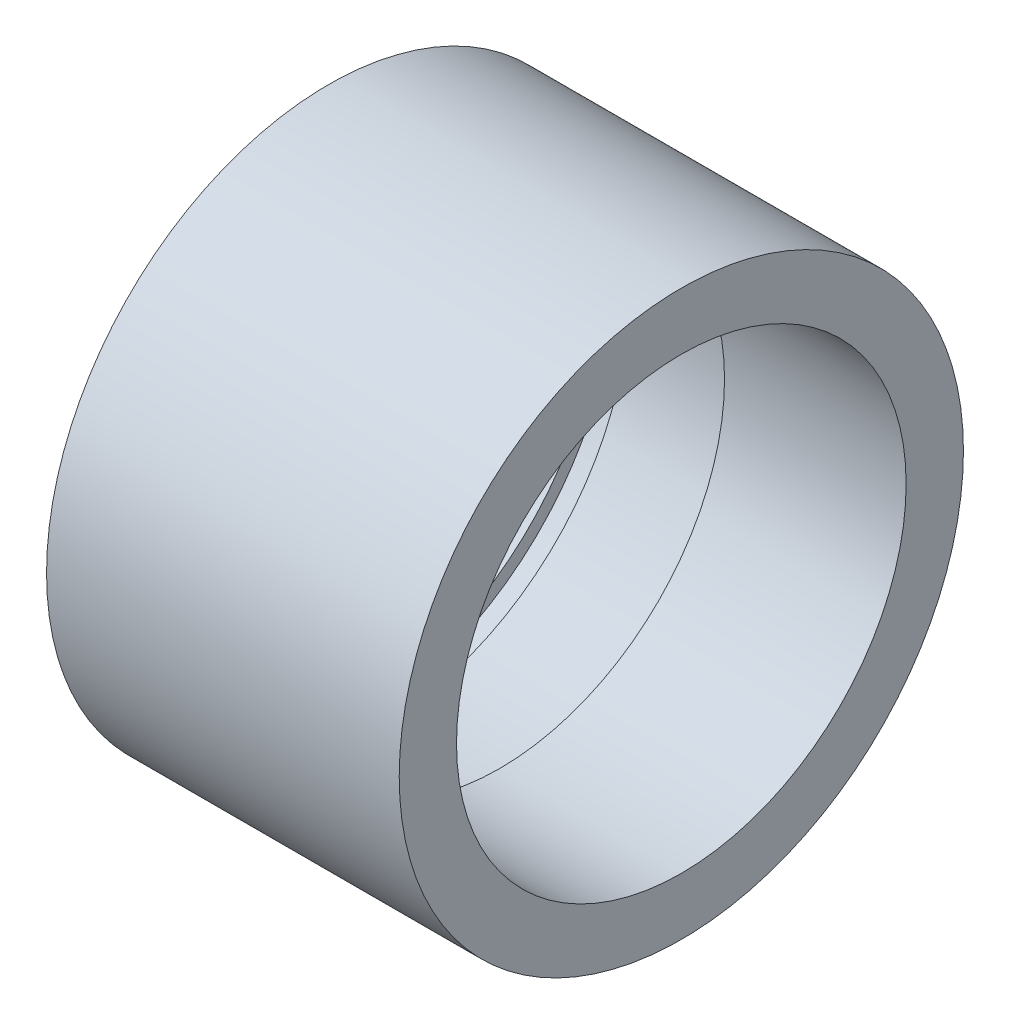
ISO-10303-21;
HEADER;
FILE_DESCRIPTION(('STEP AP214'),'2;1');
FILE_NAME('part.step','',(''),(''),'','','');
FILE_SCHEMA(('AUTOMOTIVE_DESIGN { 1 0 10303 214 1 1 1 1 }'));
ENDSEC;
DATA;
#1=APPLICATION_CONTEXT('core data for automotive mechanical design processes');
#2=APPLICATION_PROTOCOL_DEFINITION('international standard','automotive_design',2000,#1);
#3=PRODUCT_CONTEXT('',#1,'mechanical');
#4=PRODUCT('Part','Part','',(#3));
#5=PRODUCT_RELATED_PRODUCT_CATEGORY('part','',(#4));
#6=PRODUCT_DEFINITION_FORMATION('','',#4);
#7=PRODUCT_DEFINITION_CONTEXT('part definition',#1,'design');
#8=PRODUCT_DEFINITION('design','',#6,#7);
#9=PRODUCT_DEFINITION_SHAPE('','',#8);
#10=(LENGTH_UNIT() NAMED_UNIT(*) SI_UNIT(.MILLI.,.METRE.));
#11=(NAMED_UNIT(*) PLANE_ANGLE_UNIT() SI_UNIT($,.RADIAN.));
#12=(NAMED_UNIT(*) SI_UNIT($,.STERADIAN.) SOLID_ANGLE_UNIT());
#13=UNCERTAINTY_MEASURE_WITH_UNIT(LENGTH_MEASURE(1.E-05),#10,'distance_accuracy_value','');
#14=(GEOMETRIC_REPRESENTATION_CONTEXT(3) GLOBAL_UNCERTAINTY_ASSIGNED_CONTEXT((#13)) GLOBAL_UNIT_ASSIGNED_CONTEXT((#10,
#11,#12)) REPRESENTATION_CONTEXT('',''));
#15=CARTESIAN_POINT('',(0.,0.,0.));
#16=DIRECTION('',(0.,0.,1.));
#17=DIRECTION('',(1.,0.,0.));
#18=AXIS2_PLACEMENT_3D('',#15,#16,#17);
#19=CARTESIAN_POINT('',(-1.49999999999983,0.,-16.));
#20=DIRECTION('',(1.,0.,0.));
#21=DIRECTION('',(0.,0.,-1.));
#22=AXIS2_PLACEMENT_3D('',#19,#20,#21);
#23=PLANE('',#22);
#24=CARTESIAN_POINT('',(-1.49999999999983,0.,0.));
#25=DIRECTION('',(-1.,0.,0.));
#26=DIRECTION('',(0.,0.,1.));
#27=AXIS2_PLACEMENT_3D('',#24,#25,#26);
#28=CIRCLE('',#27,14.);
#29=CARTESIAN_POINT('',(-1.49999999999983,0.,14.));
#30=VERTEX_POINT('',#29);
#31=EDGE_CURVE('E10',#30,#30,#28,.T.);
#32=ORIENTED_EDGE('',*,*,#31,.F.);
#33=EDGE_LOOP('',(#32));
#34=FACE_BOUND('',#33,.T.);
#35=CARTESIAN_POINT('',(-1.49999999999983,0.,0.));
#36=DIRECTION('',(-1.,0.,0.));
#37=DIRECTION('',(0.,0.,1.));
#38=AXIS2_PLACEMENT_3D('',#35,#36,#37);
#39=CIRCLE('',#38,16.);
#40=CARTESIAN_POINT('',(-1.49999999999983,0.,16.));
#41=VERTEX_POINT('',#40);
#42=EDGE_CURVE('E67',#41,#41,#39,.T.);
#43=ORIENTED_EDGE('',*,*,#42,.T.);
#44=EDGE_LOOP('',(#43));
#45=FACE_BOUND('',#44,.T.);
#46=ADVANCED_FACE('F33',(#34,#45),#23,.F.);
#47=CARTESIAN_POINT('',(-1000.,0.,0.));
#48=DIRECTION('',(-1.,0.,0.));
#49=DIRECTION('',(0.,0.,1.));
#50=AXIS2_PLACEMENT_3D('',#47,#48,#49);
#51=CYLINDRICAL_SURFACE('',#50,14.);
#52=CARTESIAN_POINT('',(0.,0.,0.));
#53=DIRECTION('',(-1.,0.,0.));
#54=DIRECTION('',(0.,0.,1.));
#55=AXIS2_PLACEMENT_3D('',#52,#53,#54);
#56=CIRCLE('',#55,14.);
#57=CARTESIAN_POINT('',(0.,0.,14.));
#58=VERTEX_POINT('',#57);
#59=EDGE_CURVE('E39',#58,#58,#56,.T.);
#60=ORIENTED_EDGE('',*,*,#59,.F.);
#61=EDGE_LOOP('',(#60));
#62=FACE_BOUND('',#61,.T.);
#63=ORIENTED_EDGE('',*,*,#31,.T.);
#64=EDGE_LOOP('',(#63));
#65=FACE_BOUND('',#64,.T.);
#66=ADVANCED_FACE('F116',(#62,#65),#51,.F.);
#67=CARTESIAN_POINT('',(0.,0.,-14.));
#68=DIRECTION('',(-1.,0.,0.));
#69=DIRECTION('',(0.,0.,1.));
#70=AXIS2_PLACEMENT_3D('',#67,#68,#69);
#71=PLANE('',#70);
#72=CARTESIAN_POINT('',(0.,0.,0.));
#73=DIRECTION('',(-1.,0.,0.));
#74=DIRECTION('',(0.,0.,1.));
#75=AXIS2_PLACEMENT_3D('',#72,#73,#74);
#76=CIRCLE('',#75,14.7499999999999);
#77=CARTESIAN_POINT('',(0.,0.,14.7499999999999));
#78=VERTEX_POINT('',#77);
#79=EDGE_CURVE('E43',#78,#78,#76,.T.);
#80=ORIENTED_EDGE('',*,*,#79,.F.);
#81=EDGE_LOOP('',(#80));
#82=FACE_BOUND('',#81,.T.);
#83=ORIENTED_EDGE('',*,*,#59,.T.);
#84=EDGE_LOOP('',(#83));
#85=FACE_BOUND('',#84,.T.);
#86=ADVANCED_FACE('F111',(#82,#85),#71,.F.);
#87=CARTESIAN_POINT('',(-1000.,0.,0.));
#88=DIRECTION('',(-1.,0.,0.));
#89=DIRECTION('',(0.,0.,1.));
#90=AXIS2_PLACEMENT_3D('',#87,#88,#89);
#91=CYLINDRICAL_SURFACE('',#90,14.7499999999999);
#92=CARTESIAN_POINT('',(1.50000000000006,0.,0.));
#93=DIRECTION('',(-1.,0.,0.));
#94=DIRECTION('',(0.,0.,1.));
#95=AXIS2_PLACEMENT_3D('',#92,#93,#94);
#96=CIRCLE('',#95,14.7499999999999);
#97=CARTESIAN_POINT('',(1.50000000000006,0.,14.7499999999999));
#98=VERTEX_POINT('',#97);
#99=EDGE_CURVE('E47',#98,#98,#96,.T.);
#100=ORIENTED_EDGE('',*,*,#99,.F.);
#101=EDGE_LOOP('',(#100));
#102=FACE_BOUND('',#101,.T.);
#103=ORIENTED_EDGE('',*,*,#79,.T.);
#104=EDGE_LOOP('',(#103));
#105=FACE_BOUND('',#104,.T.);
#106=ADVANCED_FACE('F105',(#102,#105),#91,.F.);
#107=CARTESIAN_POINT('',(1.49999999999995,0.,-14.7499999999999));
#108=DIRECTION('',(1.,0.,0.));
#109=DIRECTION('',(0.,0.,-1.));
#110=AXIS2_PLACEMENT_3D('',#107,#108,#109);
#111=PLANE('',#110);
#112=CARTESIAN_POINT('',(1.50000000000006,0.,0.));
#113=DIRECTION('',(-1.,0.,0.));
#114=DIRECTION('',(0.,0.,1.));
#115=AXIS2_PLACEMENT_3D('',#112,#113,#114);
#116=CIRCLE('',#115,14.);
#117=CARTESIAN_POINT('',(1.50000000000006,0.,14.));
#118=VERTEX_POINT('',#117);
#119=EDGE_CURVE('E52',#118,#118,#116,.T.);
#120=ORIENTED_EDGE('',*,*,#119,.F.);
#121=EDGE_LOOP('',(#120));
#122=FACE_BOUND('',#121,.T.);
#123=ORIENTED_EDGE('',*,*,#99,.T.);
#124=EDGE_LOOP('',(#123));
#125=FACE_BOUND('',#124,.T.);
#126=ADVANCED_FACE('F99',(#122,#125),#111,.F.);
#127=CARTESIAN_POINT('',(-1000.,0.,0.));
#128=DIRECTION('',(-1.,0.,0.));
#129=DIRECTION('',(0.,0.,1.));
#130=AXIS2_PLACEMENT_3D('',#127,#128,#129);
#131=CYLINDRICAL_SURFACE('',#130,14.);
#132=CARTESIAN_POINT('',(8.19999999999999,0.,0.));
#133=DIRECTION('',(-1.,0.,0.));
#134=DIRECTION('',(0.,0.,1.));
#135=AXIS2_PLACEMENT_3D('',#132,#133,#134);
#136=CIRCLE('',#135,14.);
#137=CARTESIAN_POINT('',(8.19999999999999,0.,14.));
#138=VERTEX_POINT('',#137);
#139=EDGE_CURVE('E55',#138,#138,#136,.T.);
#140=ORIENTED_EDGE('',*,*,#139,.F.);
#141=EDGE_LOOP('',(#140));
#142=FACE_BOUND('',#141,.T.);
#143=ORIENTED_EDGE('',*,*,#119,.T.);
#144=EDGE_LOOP('',(#143));
#145=FACE_BOUND('',#144,.T.);
#146=ADVANCED_FACE('F93',(#142,#145),#131,.F.);
#147=CARTESIAN_POINT('',(8.20000000000001,0.,-14.));
#148=DIRECTION('',(1.,0.,0.));
#149=DIRECTION('',(0.,0.,-1.));
#150=AXIS2_PLACEMENT_3D('',#147,#148,#149);
#151=PLANE('',#150);
#152=CARTESIAN_POINT('',(8.19999999999999,0.,0.));
#153=DIRECTION('',(-1.,0.,0.));
#154=DIRECTION('',(0.,0.,1.));
#155=AXIS2_PLACEMENT_3D('',#152,#153,#154);
#156=CIRCLE('',#155,12.75);
#157=CARTESIAN_POINT('',(8.19999999999999,0.,12.75));
#158=VERTEX_POINT('',#157);
#159=EDGE_CURVE('E58',#158,#158,#156,.T.);
#160=ORIENTED_EDGE('',*,*,#159,.F.);
#161=EDGE_LOOP('',(#160));
#162=FACE_BOUND('',#161,.T.);
#163=ORIENTED_EDGE('',*,*,#139,.T.);
#164=EDGE_LOOP('',(#163));
#165=FACE_BOUND('',#164,.T.);
#166=ADVANCED_FACE('F87',(#162,#165),#151,.F.);
#167=CARTESIAN_POINT('',(-1000.,0.,0.));
#168=DIRECTION('',(-1.,0.,0.));
#169=DIRECTION('',(0.,0.,1.));
#170=AXIS2_PLACEMENT_3D('',#167,#168,#169);
#171=CYLINDRICAL_SURFACE('',#170,12.75);
#172=CARTESIAN_POINT('',(18.5000000000002,0.,0.));
#173=DIRECTION('',(-1.,0.,0.));
#174=DIRECTION('',(0.,0.,1.));
#175=AXIS2_PLACEMENT_3D('',#172,#173,#174);
#176=CIRCLE('',#175,12.75);
#177=CARTESIAN_POINT('',(18.5000000000002,0.,12.75));
#178=VERTEX_POINT('',#177);
#179=EDGE_CURVE('E61',#178,#178,#176,.T.);
#180=ORIENTED_EDGE('',*,*,#179,.F.);
#181=EDGE_LOOP('',(#180));
#182=FACE_BOUND('',#181,.T.);
#183=ORIENTED_EDGE('',*,*,#159,.T.);
#184=EDGE_LOOP('',(#183));
#185=FACE_BOUND('',#184,.T.);
#186=ADVANCED_FACE('F81',(#182,#185),#171,.F.);
#187=CARTESIAN_POINT('',(18.5000000000002,0.,-12.75));
#188=DIRECTION('',(-1.,0.,0.));
#189=DIRECTION('',(0.,0.,1.));
#190=AXIS2_PLACEMENT_3D('',#187,#188,#189);
#191=PLANE('',#190);
#192=CARTESIAN_POINT('',(18.5000000000002,0.,0.));
#193=DIRECTION('',(-1.,0.,0.));
#194=DIRECTION('',(0.,0.,1.));
#195=AXIS2_PLACEMENT_3D('',#192,#193,#194);
#196=CIRCLE('',#195,16.);
#197=CARTESIAN_POINT('',(18.5000000000002,0.,16.));
#198=VERTEX_POINT('',#197);
#199=EDGE_CURVE('E64',#198,#198,#196,.T.);
#200=ORIENTED_EDGE('',*,*,#199,.F.);
#201=EDGE_LOOP('',(#200));
#202=FACE_BOUND('',#201,.T.);
#203=ORIENTED_EDGE('',*,*,#179,.T.);
#204=EDGE_LOOP('',(#203));
#205=FACE_BOUND('',#204,.T.);
#206=ADVANCED_FACE('F75',(#202,#205),#191,.F.);
#207=CARTESIAN_POINT('',(-1000.,0.,0.));
#208=DIRECTION('',(-1.,0.,0.));
#209=DIRECTION('',(0.,0.,1.));
#210=AXIS2_PLACEMENT_3D('',#207,#208,#209);
#211=CYLINDRICAL_SURFACE('',#210,16.);
#212=ORIENTED_EDGE('',*,*,#42,.F.);
#213=EDGE_LOOP('',(#212));
#214=FACE_BOUND('',#213,.T.);
#215=ORIENTED_EDGE('',*,*,#199,.T.);
#216=EDGE_LOOP('',(#215));
#217=FACE_BOUND('',#216,.T.);
#218=ADVANCED_FACE('F72',(#214,#217),#211,.T.);
#219=CLOSED_SHELL('',(#46,#66,#86,#106,#126,#146,#166,#186,#206,#218));
#220=MANIFOLD_SOLID_BREP('B2',#219);
#221=ADVANCED_BREP_SHAPE_REPRESENTATION('',(#18,#220),#14);
#222=SHAPE_DEFINITION_REPRESENTATION(#9,#221);
ENDSEC;
END-ISO-10303-21;
